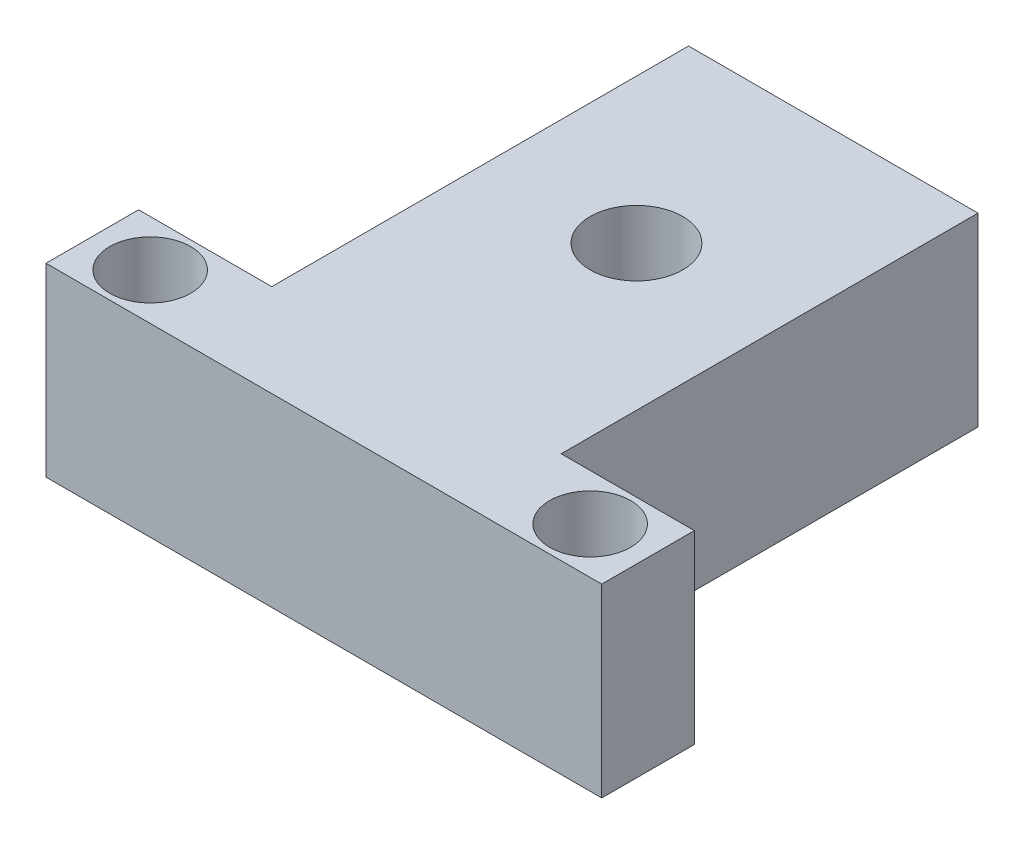
ISO-10303-21;
HEADER;
FILE_DESCRIPTION(('STEP AP214'),'2;1');
FILE_NAME('part.step','',(''),(''),'','','');
FILE_SCHEMA(('AUTOMOTIVE_DESIGN { 1 0 10303 214 1 1 1 1 }'));
ENDSEC;
DATA;
#1=APPLICATION_CONTEXT('core data for automotive mechanical design processes');
#2=APPLICATION_PROTOCOL_DEFINITION('international standard','automotive_design',2000,#1);
#3=PRODUCT_CONTEXT('',#1,'mechanical');
#4=PRODUCT('Part','Part','',(#3));
#5=PRODUCT_RELATED_PRODUCT_CATEGORY('part','',(#4));
#6=PRODUCT_DEFINITION_FORMATION('','',#4);
#7=PRODUCT_DEFINITION_CONTEXT('part definition',#1,'design');
#8=PRODUCT_DEFINITION('design','',#6,#7);
#9=PRODUCT_DEFINITION_SHAPE('','',#8);
#10=(LENGTH_UNIT() NAMED_UNIT(*) SI_UNIT(.MILLI.,.METRE.));
#11=(NAMED_UNIT(*) PLANE_ANGLE_UNIT() SI_UNIT($,.RADIAN.));
#12=(NAMED_UNIT(*) SI_UNIT($,.STERADIAN.) SOLID_ANGLE_UNIT());
#13=UNCERTAINTY_MEASURE_WITH_UNIT(LENGTH_MEASURE(1.E-05),#10,'distance_accuracy_value','');
#14=(GEOMETRIC_REPRESENTATION_CONTEXT(3) GLOBAL_UNCERTAINTY_ASSIGNED_CONTEXT((#13)) GLOBAL_UNIT_ASSIGNED_CONTEXT((#10,
#11,#12)) REPRESENTATION_CONTEXT('',''));
#15=CARTESIAN_POINT('',(0.,0.,0.));
#16=DIRECTION('',(0.,0.,1.));
#17=DIRECTION('',(1.,0.,0.));
#18=AXIS2_PLACEMENT_3D('',#15,#16,#17);
#19=CARTESIAN_POINT('',(0.,16.,-8.));
#20=DIRECTION('',(0.,-1.,0.));
#21=DIRECTION('',(0.,0.,-1.));
#22=AXIS2_PLACEMENT_3D('',#19,#20,#21);
#23=PLANE('',#22);
#24=CARTESIAN_POINT('',(5.,16.,-4.));
#25=DIRECTION('',(0.,1.,0.));
#26=DIRECTION('',(0.,0.,1.));
#27=AXIS2_PLACEMENT_3D('',#24,#25,#26);
#28=CIRCLE('',#27,3.5);
#29=CARTESIAN_POINT('',(5.,16.,-0.499999999999999));
#30=VERTEX_POINT('',#29);
#31=EDGE_CURVE('E180',#30,#30,#28,.T.);
#32=ORIENTED_EDGE('',*,*,#31,.F.);
#33=EDGE_LOOP('',(#32));
#34=FACE_BOUND('',#33,.T.);
#35=DIRECTION('',(0.,0.,1.));
#36=VECTOR('',#35,1.);
#37=CARTESIAN_POINT('',(0.,16.,0.));
#38=LINE('',#37,#36);
#39=CARTESIAN_POINT('',(0.,16.,-8.));
#40=VERTEX_POINT('',#39);
#41=CARTESIAN_POINT('',(0.,16.,0.));
#42=VERTEX_POINT('',#41);
#43=EDGE_CURVE('E143',#40,#42,#38,.T.);
#44=ORIENTED_EDGE('',*,*,#43,.T.);
#45=DIRECTION('',(1.,0.,0.));
#46=VECTOR('',#45,1.);
#47=CARTESIAN_POINT('',(0.,16.,0.));
#48=LINE('',#47,#46);
#49=CARTESIAN_POINT('',(48.,16.,0.));
#50=VERTEX_POINT('',#49);
#51=EDGE_CURVE('E91',#42,#50,#48,.T.);
#52=ORIENTED_EDGE('',*,*,#51,.T.);
#53=DIRECTION('',(0.,0.,-1.));
#54=VECTOR('',#53,1.);
#55=CARTESIAN_POINT('',(48.,16.,0.));
#56=LINE('',#55,#54);
#57=CARTESIAN_POINT('',(48.,16.,-8.));
#58=VERTEX_POINT('',#57);
#59=EDGE_CURVE('E158',#50,#58,#56,.T.);
#60=ORIENTED_EDGE('',*,*,#59,.T.);
#61=DIRECTION('',(-1.,0.,0.));
#62=VECTOR('',#61,1.);
#63=CARTESIAN_POINT('',(48.,16.,-8.));
#64=LINE('',#63,#62);
#65=CARTESIAN_POINT('',(36.5,16.,-8.));
#66=VERTEX_POINT('',#65);
#67=EDGE_CURVE('E171',#58,#66,#64,.T.);
#68=ORIENTED_EDGE('',*,*,#67,.T.);
#69=DIRECTION('',(0.,0.,-1.));
#70=VECTOR('',#69,1.);
#71=CARTESIAN_POINT('',(36.5,16.,-44.));
#72=LINE('',#71,#70);
#73=CARTESIAN_POINT('',(36.5,16.,-44.));
#74=VERTEX_POINT('',#73);
#75=EDGE_CURVE('E110',#66,#74,#72,.T.);
#76=ORIENTED_EDGE('',*,*,#75,.T.);
#77=DIRECTION('',(-1.,0.,0.));
#78=VECTOR('',#77,1.);
#79=CARTESIAN_POINT('',(11.5,16.,-44.));
#80=LINE('',#79,#78);
#81=CARTESIAN_POINT('',(11.5,16.,-44.));
#82=VERTEX_POINT('',#81);
#83=EDGE_CURVE('E104',#74,#82,#80,.T.);
#84=ORIENTED_EDGE('',*,*,#83,.T.);
#85=DIRECTION('',(0.,0.,1.));
#86=VECTOR('',#85,1.);
#87=CARTESIAN_POINT('',(11.5,16.,-44.));
#88=LINE('',#87,#86);
#89=CARTESIAN_POINT('',(11.5,16.,-8.));
#90=VERTEX_POINT('',#89);
#91=EDGE_CURVE('E108',#82,#90,#88,.T.);
#92=ORIENTED_EDGE('',*,*,#91,.T.);
#93=DIRECTION('',(-1.,0.,0.));
#94=VECTOR('',#93,1.);
#95=CARTESIAN_POINT('',(0.,16.,-8.));
#96=LINE('',#95,#94);
#97=EDGE_CURVE('E48',#90,#40,#96,.T.);
#98=ORIENTED_EDGE('',*,*,#97,.T.);
#99=EDGE_LOOP('',(#44,#52,#60,#68,#76,#84,#92,#98));
#100=FACE_BOUND('',#99,.T.);
#101=CARTESIAN_POINT('',(24.,16.,-27.));
#102=DIRECTION('',(0.,1.,0.));
#103=DIRECTION('',(0.,0.,1.));
#104=AXIS2_PLACEMENT_3D('',#101,#102,#103);
#105=CIRCLE('',#104,4.);
#106=CARTESIAN_POINT('',(24.,16.,-23.));
#107=VERTEX_POINT('',#106);
#108=EDGE_CURVE('E132',#107,#107,#105,.T.);
#109=ORIENTED_EDGE('',*,*,#108,.F.);
#110=EDGE_LOOP('',(#109));
#111=FACE_BOUND('',#110,.T.);
#112=CARTESIAN_POINT('',(43.,16.,-4.));
#113=DIRECTION('',(0.,1.,0.));
#114=DIRECTION('',(0.,0.,-1.));
#115=AXIS2_PLACEMENT_3D('',#112,#113,#114);
#116=CIRCLE('',#115,3.49999999999999);
#117=CARTESIAN_POINT('',(43.,16.,-7.49999999999999));
#118=VERTEX_POINT('',#117);
#119=EDGE_CURVE('E186',#118,#118,#116,.T.);
#120=ORIENTED_EDGE('',*,*,#119,.F.);
#121=EDGE_LOOP('',(#120));
#122=FACE_BOUND('',#121,.T.);
#123=ADVANCED_FACE('F31',(#34,#100,#111,#122),#23,.F.);
#124=CARTESIAN_POINT('',(0.,0.,-8.));
#125=DIRECTION('',(0.,-1.,0.));
#126=DIRECTION('',(0.,0.,-1.));
#127=AXIS2_PLACEMENT_3D('',#124,#125,#126);
#128=PLANE('',#127);
#129=CARTESIAN_POINT('',(5.,0.,-4.));
#130=DIRECTION('',(0.,1.,0.));
#131=DIRECTION('',(0.,0.,1.));
#132=AXIS2_PLACEMENT_3D('',#129,#130,#131);
#133=CIRCLE('',#132,3.5);
#134=CARTESIAN_POINT('',(5.,0.,-0.499999999999999));
#135=VERTEX_POINT('',#134);
#136=EDGE_CURVE('E183',#135,#135,#133,.T.);
#137=ORIENTED_EDGE('',*,*,#136,.T.);
#138=EDGE_LOOP('',(#137));
#139=FACE_BOUND('',#138,.T.);
#140=DIRECTION('',(0.,0.,1.));
#141=VECTOR('',#140,1.);
#142=CARTESIAN_POINT('',(0.,0.,0.));
#143=LINE('',#142,#141);
#144=CARTESIAN_POINT('',(0.,0.,-8.));
#145=VERTEX_POINT('',#144);
#146=CARTESIAN_POINT('',(0.,0.,0.));
#147=VERTEX_POINT('',#146);
#148=EDGE_CURVE('E128',#145,#147,#143,.T.);
#149=ORIENTED_EDGE('',*,*,#148,.F.);
#150=DIRECTION('',(-1.,0.,0.));
#151=VECTOR('',#150,1.);
#152=CARTESIAN_POINT('',(0.,0.,-8.));
#153=LINE('',#152,#151);
#154=CARTESIAN_POINT('',(11.5,0.,-8.));
#155=VERTEX_POINT('',#154);
#156=EDGE_CURVE('E83',#155,#145,#153,.T.);
#157=ORIENTED_EDGE('',*,*,#156,.F.);
#158=DIRECTION('',(0.,0.,1.));
#159=VECTOR('',#158,1.);
#160=CARTESIAN_POINT('',(11.5,0.,-44.));
#161=LINE('',#160,#159);
#162=CARTESIAN_POINT('',(11.5,0.,-44.));
#163=VERTEX_POINT('',#162);
#164=EDGE_CURVE('E77',#163,#155,#161,.T.);
#165=ORIENTED_EDGE('',*,*,#164,.F.);
#166=DIRECTION('',(-1.,0.,0.));
#167=VECTOR('',#166,1.);
#168=CARTESIAN_POINT('',(11.5,0.,-44.));
#169=LINE('',#168,#167);
#170=CARTESIAN_POINT('',(36.5,0.,-44.));
#171=VERTEX_POINT('',#170);
#172=EDGE_CURVE('E118',#171,#163,#169,.T.);
#173=ORIENTED_EDGE('',*,*,#172,.F.);
#174=DIRECTION('',(0.,0.,-1.));
#175=VECTOR('',#174,1.);
#176=CARTESIAN_POINT('',(36.5,0.,-44.));
#177=LINE('',#176,#175);
#178=CARTESIAN_POINT('',(36.5,0.,-8.));
#179=VERTEX_POINT('',#178);
#180=EDGE_CURVE('E138',#179,#171,#177,.T.);
#181=ORIENTED_EDGE('',*,*,#180,.F.);
#182=DIRECTION('',(-1.,0.,0.));
#183=VECTOR('',#182,1.);
#184=CARTESIAN_POINT('',(48.,0.,-8.));
#185=LINE('',#184,#183);
#186=CARTESIAN_POINT('',(48.,0.,-8.));
#187=VERTEX_POINT('',#186);
#188=EDGE_CURVE('E136',#187,#179,#185,.T.);
#189=ORIENTED_EDGE('',*,*,#188,.F.);
#190=DIRECTION('',(0.,0.,-1.));
#191=VECTOR('',#190,1.);
#192=CARTESIAN_POINT('',(48.,0.,0.));
#193=LINE('',#192,#191);
#194=CARTESIAN_POINT('',(48.,0.,0.));
#195=VERTEX_POINT('',#194);
#196=EDGE_CURVE('E134',#195,#187,#193,.T.);
#197=ORIENTED_EDGE('',*,*,#196,.F.);
#198=DIRECTION('',(1.,0.,0.));
#199=VECTOR('',#198,1.);
#200=CARTESIAN_POINT('',(0.,0.,0.));
#201=LINE('',#200,#199);
#202=EDGE_CURVE('E131',#147,#195,#201,.T.);
#203=ORIENTED_EDGE('',*,*,#202,.F.);
#204=EDGE_LOOP('',(#149,#157,#165,#173,#181,#189,#197,#203));
#205=FACE_BOUND('',#204,.T.);
#206=CARTESIAN_POINT('',(24.,0.,-27.));
#207=DIRECTION('',(0.,1.,0.));
#208=DIRECTION('',(0.,0.,1.));
#209=AXIS2_PLACEMENT_3D('',#206,#207,#208);
#210=CIRCLE('',#209,4.);
#211=CARTESIAN_POINT('',(24.,0.,-23.));
#212=VERTEX_POINT('',#211);
#213=EDGE_CURVE('E177',#212,#212,#210,.T.);
#214=ORIENTED_EDGE('',*,*,#213,.T.);
#215=EDGE_LOOP('',(#214));
#216=FACE_BOUND('',#215,.T.);
#217=CARTESIAN_POINT('',(43.,0.,-4.));
#218=DIRECTION('',(0.,1.,0.));
#219=DIRECTION('',(0.,0.,-1.));
#220=AXIS2_PLACEMENT_3D('',#217,#218,#219);
#221=CIRCLE('',#220,3.49999999999999);
#222=CARTESIAN_POINT('',(43.,0.,-7.49999999999999));
#223=VERTEX_POINT('',#222);
#224=EDGE_CURVE('E189',#223,#223,#221,.T.);
#225=ORIENTED_EDGE('',*,*,#224,.T.);
#226=EDGE_LOOP('',(#225));
#227=FACE_BOUND('',#226,.T.);
#228=ADVANCED_FACE('F162',(#139,#205,#216,#227),#128,.T.);
#229=CARTESIAN_POINT('',(0.,16.,0.));
#230=DIRECTION('',(1.,0.,0.));
#231=DIRECTION('',(0.,0.,-1.));
#232=AXIS2_PLACEMENT_3D('',#229,#230,#231);
#233=PLANE('',#232);
#234=ORIENTED_EDGE('',*,*,#148,.T.);
#235=DIRECTION('',(0.,-1.,0.));
#236=VECTOR('',#235,1.);
#237=CARTESIAN_POINT('',(0.,16.,0.));
#238=LINE('',#237,#236);
#239=EDGE_CURVE('E11',#42,#147,#238,.T.);
#240=ORIENTED_EDGE('',*,*,#239,.F.);
#241=ORIENTED_EDGE('',*,*,#43,.F.);
#242=DIRECTION('',(0.,-1.,0.));
#243=VECTOR('',#242,1.);
#244=CARTESIAN_POINT('',(0.,16.,-8.));
#245=LINE('',#244,#243);
#246=EDGE_CURVE('E124',#40,#145,#245,.T.);
#247=ORIENTED_EDGE('',*,*,#246,.T.);
#248=EDGE_LOOP('',(#234,#240,#241,#247));
#249=FACE_BOUND('',#248,.T.);
#250=ADVANCED_FACE('F33',(#249),#233,.F.);
#251=CARTESIAN_POINT('',(0.,16.,0.));
#252=DIRECTION('',(0.,0.,-1.));
#253=DIRECTION('',(-1.,0.,0.));
#254=AXIS2_PLACEMENT_3D('',#251,#252,#253);
#255=PLANE('',#254);
#256=ORIENTED_EDGE('',*,*,#202,.T.);
#257=DIRECTION('',(0.,-1.,0.));
#258=VECTOR('',#257,1.);
#259=CARTESIAN_POINT('',(48.,16.,0.));
#260=LINE('',#259,#258);
#261=EDGE_CURVE('E40',#50,#195,#260,.T.);
#262=ORIENTED_EDGE('',*,*,#261,.F.);
#263=ORIENTED_EDGE('',*,*,#51,.F.);
#264=ORIENTED_EDGE('',*,*,#239,.T.);
#265=EDGE_LOOP('',(#256,#262,#263,#264));
#266=FACE_BOUND('',#265,.T.);
#267=ADVANCED_FACE('F223',(#266),#255,.F.);
#268=CARTESIAN_POINT('',(48.,16.,0.));
#269=DIRECTION('',(-1.,0.,0.));
#270=DIRECTION('',(0.,0.,1.));
#271=AXIS2_PLACEMENT_3D('',#268,#269,#270);
#272=PLANE('',#271);
#273=ORIENTED_EDGE('',*,*,#196,.T.);
#274=DIRECTION('',(0.,-1.,0.));
#275=VECTOR('',#274,1.);
#276=CARTESIAN_POINT('',(48.,16.,-8.));
#277=LINE('',#276,#275);
#278=EDGE_CURVE('E150',#58,#187,#277,.T.);
#279=ORIENTED_EDGE('',*,*,#278,.F.);
#280=ORIENTED_EDGE('',*,*,#59,.F.);
#281=ORIENTED_EDGE('',*,*,#261,.T.);
#282=EDGE_LOOP('',(#273,#279,#280,#281));
#283=FACE_BOUND('',#282,.T.);
#284=ADVANCED_FACE('F156',(#283),#272,.F.);
#285=CARTESIAN_POINT('',(48.,16.,-8.));
#286=DIRECTION('',(0.,0.,1.));
#287=DIRECTION('',(1.,0.,0.));
#288=AXIS2_PLACEMENT_3D('',#285,#286,#287);
#289=PLANE('',#288);
#290=ORIENTED_EDGE('',*,*,#188,.T.);
#291=DIRECTION('',(0.,-1.,0.));
#292=VECTOR('',#291,1.);
#293=CARTESIAN_POINT('',(36.5,16.,-8.));
#294=LINE('',#293,#292);
#295=EDGE_CURVE('E147',#66,#179,#294,.T.);
#296=ORIENTED_EDGE('',*,*,#295,.F.);
#297=ORIENTED_EDGE('',*,*,#67,.F.);
#298=ORIENTED_EDGE('',*,*,#278,.T.);
#299=EDGE_LOOP('',(#290,#296,#297,#298));
#300=FACE_BOUND('',#299,.T.);
#301=ADVANCED_FACE('F167',(#300),#289,.F.);
#302=CARTESIAN_POINT('',(36.5,16.,-44.));
#303=DIRECTION('',(-1.,0.,0.));
#304=DIRECTION('',(0.,0.,1.));
#305=AXIS2_PLACEMENT_3D('',#302,#303,#304);
#306=PLANE('',#305);
#307=ORIENTED_EDGE('',*,*,#180,.T.);
#308=DIRECTION('',(0.,-1.,0.));
#309=VECTOR('',#308,1.);
#310=CARTESIAN_POINT('',(36.5,16.,-44.));
#311=LINE('',#310,#309);
#312=EDGE_CURVE('E119',#74,#171,#311,.T.);
#313=ORIENTED_EDGE('',*,*,#312,.F.);
#314=ORIENTED_EDGE('',*,*,#75,.F.);
#315=ORIENTED_EDGE('',*,*,#295,.T.);
#316=EDGE_LOOP('',(#307,#313,#314,#315));
#317=FACE_BOUND('',#316,.T.);
#318=ADVANCED_FACE('F170',(#317),#306,.F.);
#319=CARTESIAN_POINT('',(11.5,16.,-44.));
#320=DIRECTION('',(0.,0.,1.));
#321=DIRECTION('',(1.,0.,0.));
#322=AXIS2_PLACEMENT_3D('',#319,#320,#321);
#323=PLANE('',#322);
#324=ORIENTED_EDGE('',*,*,#172,.T.);
#325=DIRECTION('',(0.,-1.,0.));
#326=VECTOR('',#325,1.);
#327=CARTESIAN_POINT('',(11.5,16.,-44.));
#328=LINE('',#327,#326);
#329=EDGE_CURVE('E115',#82,#163,#328,.T.);
#330=ORIENTED_EDGE('',*,*,#329,.F.);
#331=ORIENTED_EDGE('',*,*,#83,.F.);
#332=ORIENTED_EDGE('',*,*,#312,.T.);
#333=EDGE_LOOP('',(#324,#330,#331,#332));
#334=FACE_BOUND('',#333,.T.);
#335=ADVANCED_FACE('F116',(#334),#323,.F.);
#336=CARTESIAN_POINT('',(11.5,16.,-44.));
#337=DIRECTION('',(1.,0.,0.));
#338=DIRECTION('',(0.,0.,-1.));
#339=AXIS2_PLACEMENT_3D('',#336,#337,#338);
#340=PLANE('',#339);
#341=ORIENTED_EDGE('',*,*,#164,.T.);
#342=DIRECTION('',(0.,-1.,0.));
#343=VECTOR('',#342,1.);
#344=CARTESIAN_POINT('',(11.5,16.,-8.));
#345=LINE('',#344,#343);
#346=EDGE_CURVE('E120',#90,#155,#345,.T.);
#347=ORIENTED_EDGE('',*,*,#346,.F.);
#348=ORIENTED_EDGE('',*,*,#91,.F.);
#349=ORIENTED_EDGE('',*,*,#329,.T.);
#350=EDGE_LOOP('',(#341,#347,#348,#349));
#351=FACE_BOUND('',#350,.T.);
#352=ADVANCED_FACE('F122',(#351),#340,.F.);
#353=CARTESIAN_POINT('',(0.,16.,-8.));
#354=DIRECTION('',(0.,0.,1.));
#355=DIRECTION('',(1.,0.,0.));
#356=AXIS2_PLACEMENT_3D('',#353,#354,#355);
#357=PLANE('',#356);
#358=ORIENTED_EDGE('',*,*,#156,.T.);
#359=ORIENTED_EDGE('',*,*,#246,.F.);
#360=ORIENTED_EDGE('',*,*,#97,.F.);
#361=ORIENTED_EDGE('',*,*,#346,.T.);
#362=EDGE_LOOP('',(#358,#359,#360,#361));
#363=FACE_BOUND('',#362,.T.);
#364=ADVANCED_FACE('F211',(#363),#357,.F.);
#365=CARTESIAN_POINT('',(24.,16.,-27.));
#366=DIRECTION('',(0.,-1.,0.));
#367=DIRECTION('',(0.,0.,-1.));
#368=AXIS2_PLACEMENT_3D('',#365,#366,#367);
#369=CYLINDRICAL_SURFACE('',#368,4.);
#370=ORIENTED_EDGE('',*,*,#108,.T.);
#371=EDGE_LOOP('',(#370));
#372=FACE_BOUND('',#371,.T.);
#373=ORIENTED_EDGE('',*,*,#213,.F.);
#374=EDGE_LOOP('',(#373));
#375=FACE_BOUND('',#374,.T.);
#376=ADVANCED_FACE('F208',(#372,#375),#369,.F.);
#377=CARTESIAN_POINT('',(5.,16.,-4.));
#378=DIRECTION('',(0.,-1.,0.));
#379=DIRECTION('',(0.,0.,-1.));
#380=AXIS2_PLACEMENT_3D('',#377,#378,#379);
#381=CYLINDRICAL_SURFACE('',#380,3.5);
#382=ORIENTED_EDGE('',*,*,#31,.T.);
#383=EDGE_LOOP('',(#382));
#384=FACE_BOUND('',#383,.T.);
#385=ORIENTED_EDGE('',*,*,#136,.F.);
#386=EDGE_LOOP('',(#385));
#387=FACE_BOUND('',#386,.T.);
#388=ADVANCED_FACE('F287',(#384,#387),#381,.F.);
#389=CARTESIAN_POINT('',(43.,16.,-4.));
#390=DIRECTION('',(0.,-1.,0.));
#391=DIRECTION('',(0.,0.,-1.));
#392=AXIS2_PLACEMENT_3D('',#389,#390,#391);
#393=CYLINDRICAL_SURFACE('',#392,3.49999999999999);
#394=ORIENTED_EDGE('',*,*,#119,.T.);
#395=EDGE_LOOP('',(#394));
#396=FACE_BOUND('',#395,.T.);
#397=ORIENTED_EDGE('',*,*,#224,.F.);
#398=EDGE_LOOP('',(#397));
#399=FACE_BOUND('',#398,.T.);
#400=ADVANCED_FACE('F195',(#396,#399),#393,.F.);
#401=CLOSED_SHELL('',(#123,#228,#250,#267,#284,#301,#318,#335,#352,#364,#376,#388,#400));
#402=MANIFOLD_SOLID_BREP('B2',#401);
#403=ADVANCED_BREP_SHAPE_REPRESENTATION('',(#18,#402),#14);
#404=SHAPE_DEFINITION_REPRESENTATION(#9,#403);
ENDSEC;
END-ISO-10303-21;
